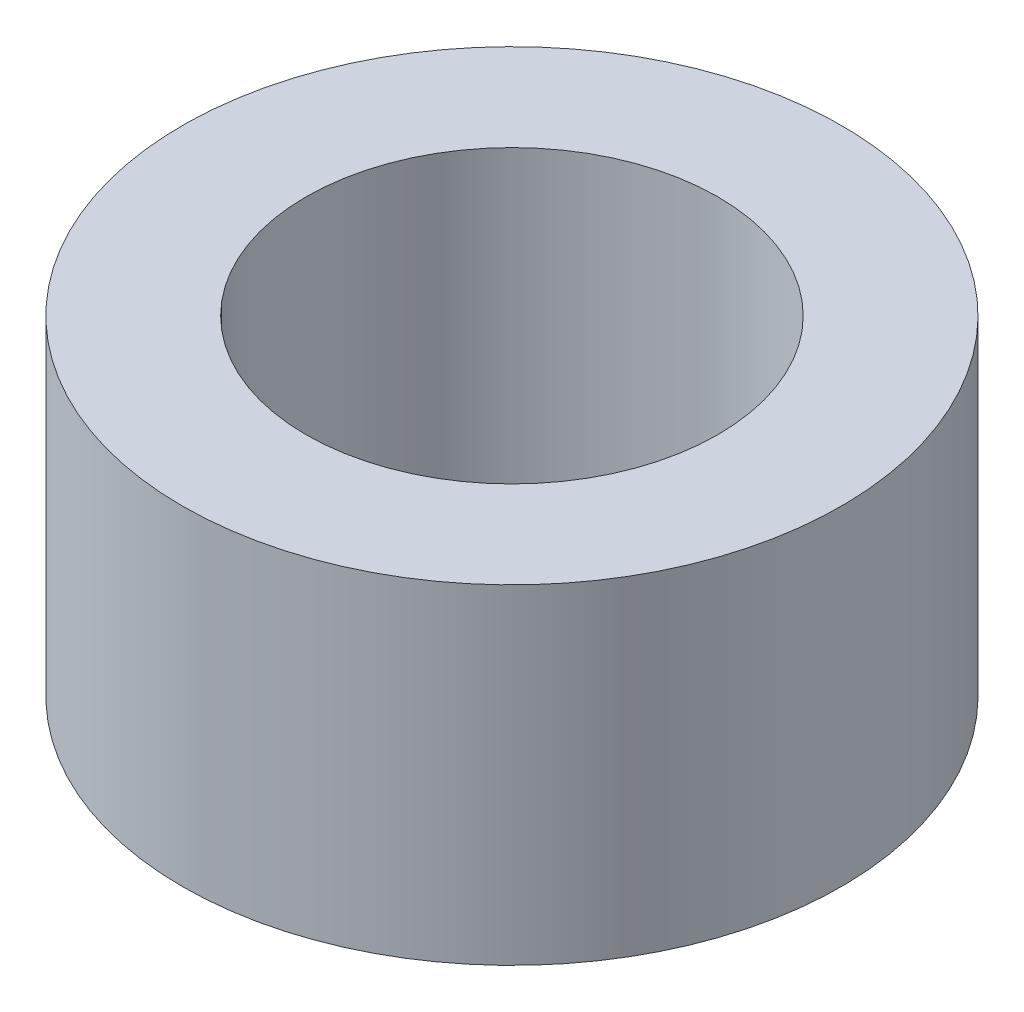
ISO-10303-21;
HEADER;
FILE_DESCRIPTION(('STEP AP214'),'2;1');
FILE_NAME('part.step','',(''),(''),'','','');
FILE_SCHEMA(('AUTOMOTIVE_DESIGN { 1 0 10303 214 1 1 1 1 }'));
ENDSEC;
DATA;
#1=APPLICATION_CONTEXT('core data for automotive mechanical design processes');
#2=APPLICATION_PROTOCOL_DEFINITION('international standard','automotive_design',2000,#1);
#3=PRODUCT_CONTEXT('',#1,'mechanical');
#4=PRODUCT('Part','Part','',(#3));
#5=PRODUCT_RELATED_PRODUCT_CATEGORY('part','',(#4));
#6=PRODUCT_DEFINITION_FORMATION('','',#4);
#7=PRODUCT_DEFINITION_CONTEXT('part definition',#1,'design');
#8=PRODUCT_DEFINITION('design','',#6,#7);
#9=PRODUCT_DEFINITION_SHAPE('','',#8);
#10=(LENGTH_UNIT() NAMED_UNIT(*) SI_UNIT(.MILLI.,.METRE.));
#11=(NAMED_UNIT(*) PLANE_ANGLE_UNIT() SI_UNIT($,.RADIAN.));
#12=(NAMED_UNIT(*) SI_UNIT($,.STERADIAN.) SOLID_ANGLE_UNIT());
#13=UNCERTAINTY_MEASURE_WITH_UNIT(LENGTH_MEASURE(1.E-05),#10,'distance_accuracy_value','');
#14=(GEOMETRIC_REPRESENTATION_CONTEXT(3) GLOBAL_UNCERTAINTY_ASSIGNED_CONTEXT((#13)) GLOBAL_UNIT_ASSIGNED_CONTEXT((#10,
#11,#12)) REPRESENTATION_CONTEXT('',''));
#15=CARTESIAN_POINT('',(0.,0.,0.));
#16=DIRECTION('',(0.,0.,1.));
#17=DIRECTION('',(1.,0.,0.));
#18=AXIS2_PLACEMENT_3D('',#15,#16,#17);
#19=CARTESIAN_POINT('',(0.,5.,0.));
#20=DIRECTION('',(0.,1.,0.));
#21=DIRECTION('',(0.,0.,1.));
#22=AXIS2_PLACEMENT_3D('',#19,#20,#21);
#23=PLANE('',#22);
#24=CARTESIAN_POINT('',(0.,5.,0.));
#25=DIRECTION('',(0.,1.,0.));
#26=DIRECTION('',(0.,0.,1.));
#27=AXIS2_PLACEMENT_3D('',#24,#25,#26);
#28=CIRCLE('',#27,5.);
#29=CARTESIAN_POINT('',(0.,5.,5.));
#30=VERTEX_POINT('',#29);
#31=EDGE_CURVE('E10',#30,#30,#28,.T.);
#32=ORIENTED_EDGE('',*,*,#31,.T.);
#33=EDGE_LOOP('',(#32));
#34=FACE_BOUND('',#33,.T.);
#35=CARTESIAN_POINT('',(0.,5.,0.));
#36=DIRECTION('',(0.,1.,0.));
#37=DIRECTION('',(0.,0.,1.));
#38=AXIS2_PLACEMENT_3D('',#35,#36,#37);
#39=CIRCLE('',#38,3.125);
#40=CARTESIAN_POINT('',(0.,5.,3.125));
#41=VERTEX_POINT('',#40);
#42=EDGE_CURVE('E46',#41,#41,#39,.T.);
#43=ORIENTED_EDGE('',*,*,#42,.F.);
#44=EDGE_LOOP('',(#43));
#45=FACE_BOUND('',#44,.T.);
#46=ADVANCED_FACE('F35',(#34,#45),#23,.T.);
#47=CARTESIAN_POINT('',(0.,0.,0.));
#48=DIRECTION('',(0.,1.,0.));
#49=DIRECTION('',(0.,0.,1.));
#50=AXIS2_PLACEMENT_3D('',#47,#48,#49);
#51=PLANE('',#50);
#52=CARTESIAN_POINT('',(0.,0.,0.));
#53=DIRECTION('',(0.,1.,0.));
#54=DIRECTION('',(0.,0.,1.));
#55=AXIS2_PLACEMENT_3D('',#52,#53,#54);
#56=CIRCLE('',#55,5.);
#57=CARTESIAN_POINT('',(0.,0.,5.));
#58=VERTEX_POINT('',#57);
#59=EDGE_CURVE('E39',#58,#58,#56,.T.);
#60=ORIENTED_EDGE('',*,*,#59,.F.);
#61=EDGE_LOOP('',(#60));
#62=FACE_BOUND('',#61,.T.);
#63=CARTESIAN_POINT('',(0.,0.,0.));
#64=DIRECTION('',(0.,1.,0.));
#65=DIRECTION('',(0.,0.,1.));
#66=AXIS2_PLACEMENT_3D('',#63,#64,#65);
#67=CIRCLE('',#66,3.125);
#68=CARTESIAN_POINT('',(0.,0.,3.125));
#69=VERTEX_POINT('',#68);
#70=EDGE_CURVE('E48',#69,#69,#67,.T.);
#71=ORIENTED_EDGE('',*,*,#70,.T.);
#72=EDGE_LOOP('',(#71));
#73=FACE_BOUND('',#72,.T.);
#74=ADVANCED_FACE('F58',(#62,#73),#51,.F.);
#75=CARTESIAN_POINT('',(0.,5.,0.));
#76=DIRECTION('',(0.,-1.,0.));
#77=DIRECTION('',(0.,0.,-1.));
#78=AXIS2_PLACEMENT_3D('',#75,#76,#77);
#79=CYLINDRICAL_SURFACE('',#78,5.);
#80=ORIENTED_EDGE('',*,*,#31,.F.);
#81=EDGE_LOOP('',(#80));
#82=FACE_BOUND('',#81,.T.);
#83=ORIENTED_EDGE('',*,*,#59,.T.);
#84=EDGE_LOOP('',(#83));
#85=FACE_BOUND('',#84,.T.);
#86=ADVANCED_FACE('F37',(#82,#85),#79,.T.);
#87=CARTESIAN_POINT('',(0.,5.,0.));
#88=DIRECTION('',(0.,-1.,0.));
#89=DIRECTION('',(0.,0.,-1.));
#90=AXIS2_PLACEMENT_3D('',#87,#88,#89);
#91=CYLINDRICAL_SURFACE('',#90,3.125);
#92=ORIENTED_EDGE('',*,*,#42,.T.);
#93=EDGE_LOOP('',(#92));
#94=FACE_BOUND('',#93,.T.);
#95=ORIENTED_EDGE('',*,*,#70,.F.);
#96=EDGE_LOOP('',(#95));
#97=FACE_BOUND('',#96,.T.);
#98=ADVANCED_FACE('F54',(#94,#97),#91,.F.);
#99=CLOSED_SHELL('',(#46,#74,#86,#98));
#100=MANIFOLD_SOLID_BREP('B2',#99);
#101=ADVANCED_BREP_SHAPE_REPRESENTATION('',(#18,#100),#14);
#102=SHAPE_DEFINITION_REPRESENTATION(#9,#101);
ENDSEC;
END-ISO-10303-21;
